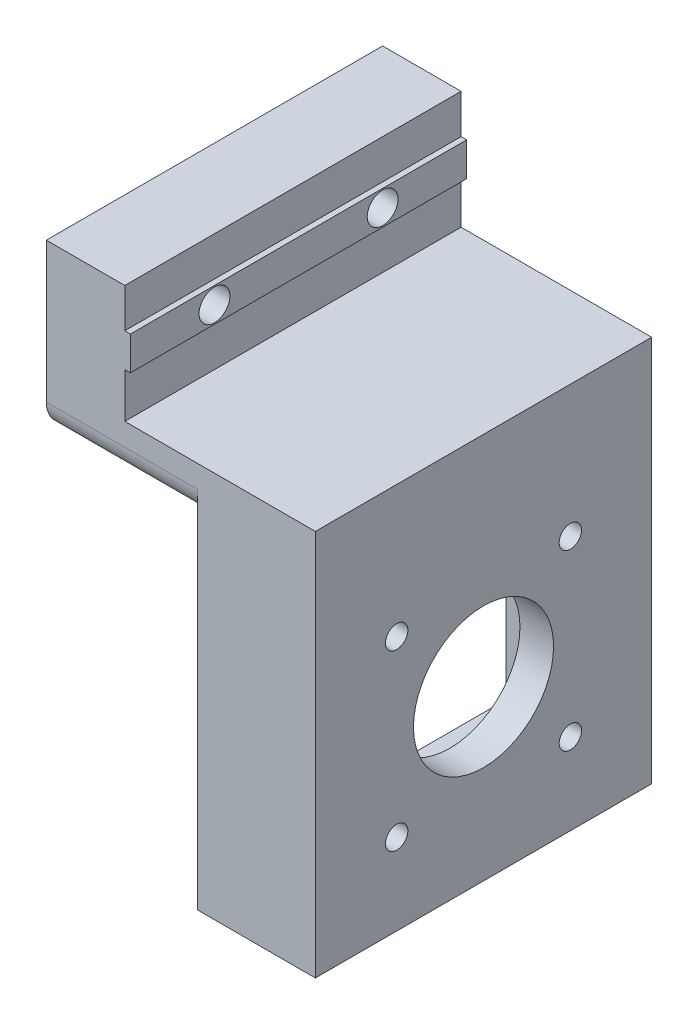
ISO-10303-21;
HEADER;
FILE_DESCRIPTION(('STEP AP214'),'2;1');
FILE_NAME('part.step','',(''),(''),'','','');
FILE_SCHEMA(('AUTOMOTIVE_DESIGN { 1 0 10303 214 1 1 1 1 }'));
ENDSEC;
DATA;
#1=APPLICATION_CONTEXT('core data for automotive mechanical design processes');
#2=APPLICATION_PROTOCOL_DEFINITION('international standard','automotive_design',2000,#1);
#3=PRODUCT_CONTEXT('',#1,'mechanical');
#4=PRODUCT('Part','Part','',(#3));
#5=PRODUCT_RELATED_PRODUCT_CATEGORY('part','',(#4));
#6=PRODUCT_DEFINITION_FORMATION('','',#4);
#7=PRODUCT_DEFINITION_CONTEXT('part definition',#1,'design');
#8=PRODUCT_DEFINITION('design','',#6,#7);
#9=PRODUCT_DEFINITION_SHAPE('','',#8);
#10=(LENGTH_UNIT() NAMED_UNIT(*) SI_UNIT(.MILLI.,.METRE.));
#11=(NAMED_UNIT(*) PLANE_ANGLE_UNIT() SI_UNIT($,.RADIAN.));
#12=(NAMED_UNIT(*) SI_UNIT($,.STERADIAN.) SOLID_ANGLE_UNIT());
#13=UNCERTAINTY_MEASURE_WITH_UNIT(LENGTH_MEASURE(1.E-05),#10,'distance_accuracy_value','');
#14=(GEOMETRIC_REPRESENTATION_CONTEXT(3) GLOBAL_UNCERTAINTY_ASSIGNED_CONTEXT((#13)) GLOBAL_UNIT_ASSIGNED_CONTEXT((#10,
#11,#12)) REPRESENTATION_CONTEXT('',''));
#15=CARTESIAN_POINT('',(0.,0.,0.));
#16=DIRECTION('',(0.,0.,1.));
#17=DIRECTION('',(1.,0.,0.));
#18=AXIS2_PLACEMENT_3D('',#15,#16,#17);
#19=CARTESIAN_POINT('',(48.001,-9.99999999999999,45.));
#20=DIRECTION('',(-1.,0.,0.));
#21=DIRECTION('',(0.,-1.,0.));
#22=AXIS2_PLACEMENT_3D('',#19,#20,#21);
#23=CYLINDRICAL_SURFACE('',#22,2.75);
#24=CARTESIAN_POINT('',(15.,-10.,45.));
#25=DIRECTION('',(1.,0.,0.));
#26=DIRECTION('',(0.,0.,-1.));
#27=AXIS2_PLACEMENT_3D('',#24,#25,#26);
#28=CIRCLE('',#27,2.75);
#29=CARTESIAN_POINT('',(15.,-10.,42.25));
#30=VERTEX_POINT('',#29);
#31=EDGE_CURVE('E307',#30,#30,#28,.F.);
#32=ORIENTED_EDGE('',*,*,#31,.F.);
#33=EDGE_LOOP('',(#32));
#34=FACE_BOUND('',#33,.T.);
#35=CARTESIAN_POINT('',(8.,-10.,45.));
#36=DIRECTION('',(-1.,0.,0.));
#37=DIRECTION('',(0.,-1.,0.));
#38=AXIS2_PLACEMENT_3D('',#35,#36,#37);
#39=CIRCLE('',#38,2.75);
#40=CARTESIAN_POINT('',(8.,-12.75,45.));
#41=VERTEX_POINT('',#40);
#42=EDGE_CURVE('E303',#41,#41,#39,.F.);
#43=ORIENTED_EDGE('',*,*,#42,.F.);
#44=EDGE_LOOP('',(#43));
#45=FACE_BOUND('',#44,.T.);
#46=ADVANCED_FACE('F39',(#34,#45),#23,.F.);
#47=CARTESIAN_POINT('',(48.001,-9.99999999999999,15.));
#48=DIRECTION('',(-1.,0.,0.));
#49=DIRECTION('',(0.,-1.,0.));
#50=AXIS2_PLACEMENT_3D('',#47,#48,#49);
#51=CYLINDRICAL_SURFACE('',#50,2.75);
#52=CARTESIAN_POINT('',(15.,-10.,15.));
#53=DIRECTION('',(1.,0.,0.));
#54=DIRECTION('',(0.,0.,-1.));
#55=AXIS2_PLACEMENT_3D('',#52,#53,#54);
#56=CIRCLE('',#55,2.75);
#57=CARTESIAN_POINT('',(15.,-10.,12.25));
#58=VERTEX_POINT('',#57);
#59=EDGE_CURVE('E669',#58,#58,#56,.F.);
#60=ORIENTED_EDGE('',*,*,#59,.F.);
#61=EDGE_LOOP('',(#60));
#62=FACE_BOUND('',#61,.T.);
#63=CARTESIAN_POINT('',(8.,-10.,15.));
#64=DIRECTION('',(-1.,0.,0.));
#65=DIRECTION('',(0.,-1.,0.));
#66=AXIS2_PLACEMENT_3D('',#63,#64,#65);
#67=CIRCLE('',#66,2.75);
#68=CARTESIAN_POINT('',(8.,-12.75,15.));
#69=VERTEX_POINT('',#68);
#70=EDGE_CURVE('E300',#69,#69,#67,.F.);
#71=ORIENTED_EDGE('',*,*,#70,.F.);
#72=EDGE_LOOP('',(#71));
#73=FACE_BOUND('',#72,.T.);
#74=ADVANCED_FACE('F370',(#62,#73),#51,.F.);
#75=CARTESIAN_POINT('',(14.,-21.,60.));
#76=DIRECTION('',(-1.,0.,0.));
#77=DIRECTION('',(0.,0.,1.));
#78=AXIS2_PLACEMENT_3D('',#75,#76,#77);
#79=PLANE('',#78);
#80=DIRECTION('',(0.,0.,-1.));
#81=VECTOR('',#80,1.);
#82=CARTESIAN_POINT('',(14.,-13.,60.));
#83=LINE('',#82,#81);
#84=CARTESIAN_POINT('',(14.,-13.,60.));
#85=VERTEX_POINT('',#84);
#86=CARTESIAN_POINT('',(14.,-13.,0.));
#87=VERTEX_POINT('',#86);
#88=EDGE_CURVE('E672',#85,#87,#83,.T.);
#89=ORIENTED_EDGE('',*,*,#88,.F.);
#90=DIRECTION('',(0.,1.,0.));
#91=VECTOR('',#90,1.);
#92=CARTESIAN_POINT('',(14.,-21.,60.));
#93=LINE('',#92,#91);
#94=CARTESIAN_POINT('',(14.,-21.,60.));
#95=VERTEX_POINT('',#94);
#96=EDGE_CURVE('E182',#95,#85,#93,.T.);
#97=ORIENTED_EDGE('',*,*,#96,.F.);
#98=DIRECTION('',(0.,0.,-1.));
#99=VECTOR('',#98,1.);
#100=CARTESIAN_POINT('',(14.,-21.,60.));
#101=LINE('',#100,#99);
#102=CARTESIAN_POINT('',(14.,-21.,0.));
#103=VERTEX_POINT('',#102);
#104=EDGE_CURVE('E281',#95,#103,#101,.T.);
#105=ORIENTED_EDGE('',*,*,#104,.T.);
#106=DIRECTION('',(0.,1.,0.));
#107=VECTOR('',#106,1.);
#108=CARTESIAN_POINT('',(14.,-21.,0.));
#109=LINE('',#108,#107);
#110=EDGE_CURVE('E256',#103,#87,#109,.T.);
#111=ORIENTED_EDGE('',*,*,#110,.T.);
#112=EDGE_LOOP('',(#89,#97,#105,#111));
#113=FACE_BOUND('',#112,.T.);
#114=ADVANCED_FACE('F377',(#113),#79,.F.);
#115=DIRECTION('',(0.,0.,1.));
#116=VECTOR('',#115,1.);
#117=CARTESIAN_POINT('',(14.,-7.,60.));
#118=LINE('',#117,#116);
#119=CARTESIAN_POINT('',(14.,-6.99999999999999,0.));
#120=VERTEX_POINT('',#119);
#121=CARTESIAN_POINT('',(14.,-7.,60.));
#122=VERTEX_POINT('',#121);
#123=EDGE_CURVE('E176',#120,#122,#118,.T.);
#124=ORIENTED_EDGE('',*,*,#123,.F.);
#125=CARTESIAN_POINT('',(14.,0.,0.));
#126=VERTEX_POINT('',#125);
#127=EDGE_CURVE('E277',#120,#126,#109,.T.);
#128=ORIENTED_EDGE('',*,*,#127,.T.);
#129=DIRECTION('',(0.,0.,-1.));
#130=VECTOR('',#129,1.);
#131=CARTESIAN_POINT('',(14.,0.,60.));
#132=LINE('',#131,#130);
#133=CARTESIAN_POINT('',(14.,0.,60.));
#134=VERTEX_POINT('',#133);
#135=EDGE_CURVE('E266',#134,#126,#132,.T.);
#136=ORIENTED_EDGE('',*,*,#135,.F.);
#137=EDGE_CURVE('E264',#122,#134,#93,.T.);
#138=ORIENTED_EDGE('',*,*,#137,.F.);
#139=EDGE_LOOP('',(#124,#128,#136,#138));
#140=FACE_BOUND('',#139,.T.);
#141=ADVANCED_FACE('F480',(#140),#79,.F.);
#142=CARTESIAN_POINT('',(0.,-30.,60.));
#143=DIRECTION('',(0.,1.,0.));
#144=DIRECTION('',(0.,0.,1.));
#145=AXIS2_PLACEMENT_3D('',#142,#143,#144);
#146=PLANE('',#145);
#147=DIRECTION('',(1.,0.,0.));
#148=VECTOR('',#147,1.);
#149=CARTESIAN_POINT('',(27.,-30.,55.));
#150=LINE('',#149,#148);
#151=CARTESIAN_POINT('',(27.,-30.,55.));
#152=VERTEX_POINT('',#151);
#153=CARTESIAN_POINT('',(42.,-30.,55.));
#154=VERTEX_POINT('',#153);
#155=EDGE_CURVE('E218',#152,#154,#150,.T.);
#156=ORIENTED_EDGE('',*,*,#155,.F.);
#157=DIRECTION('',(1.,0.,0.));
#158=VECTOR('',#157,1.);
#159=CARTESIAN_POINT('',(0.,-30.,55.));
#160=LINE('',#159,#158);
#161=CARTESIAN_POINT('',(0.,-30.,55.));
#162=VERTEX_POINT('',#161);
#163=EDGE_CURVE('E313',#152,#162,#160,.F.);
#164=ORIENTED_EDGE('',*,*,#163,.T.);
#165=DIRECTION('',(0.,0.,-1.));
#166=VECTOR('',#165,1.);
#167=CARTESIAN_POINT('',(0.,-30.,60.));
#168=LINE('',#167,#166);
#169=CARTESIAN_POINT('',(0.,-30.,5.));
#170=VERTEX_POINT('',#169);
#171=EDGE_CURVE('E293',#162,#170,#168,.T.);
#172=ORIENTED_EDGE('',*,*,#171,.T.);
#173=DIRECTION('',(1.,0.,0.));
#174=VECTOR('',#173,1.);
#175=CARTESIAN_POINT('',(0.,-30.,5.));
#176=LINE('',#175,#174);
#177=CARTESIAN_POINT('',(27.,-30.,5.));
#178=VERTEX_POINT('',#177);
#179=EDGE_CURVE('E310',#170,#178,#176,.T.);
#180=ORIENTED_EDGE('',*,*,#179,.T.);
#181=DIRECTION('',(1.,0.,0.));
#182=VECTOR('',#181,1.);
#183=CARTESIAN_POINT('',(27.,-30.,5.));
#184=LINE('',#183,#182);
#185=CARTESIAN_POINT('',(42.,-30.,5.));
#186=VERTEX_POINT('',#185);
#187=EDGE_CURVE('E205',#178,#186,#184,.T.);
#188=ORIENTED_EDGE('',*,*,#187,.T.);
#189=DIRECTION('',(0.,0.,-1.));
#190=VECTOR('',#189,1.);
#191=CARTESIAN_POINT('',(42.,-30.,60.));
#192=LINE('',#191,#190);
#193=EDGE_CURVE('E290',#154,#186,#192,.T.);
#194=ORIENTED_EDGE('',*,*,#193,.F.);
#195=EDGE_LOOP('',(#156,#164,#172,#180,#188,#194));
#196=FACE_BOUND('',#195,.T.);
#197=ADVANCED_FACE('F331',(#196),#146,.F.);
#198=CARTESIAN_POINT('',(42.,-30.,60.));
#199=DIRECTION('',(1.,0.,0.));
#200=DIRECTION('',(0.,0.,-1.));
#201=AXIS2_PLACEMENT_3D('',#198,#199,#200);
#202=PLANE('',#201);
#203=CARTESIAN_POINT('',(42.,-44.5,45.5));
#204=DIRECTION('',(1.,0.,0.));
#205=DIRECTION('',(0.,0.,-1.));
#206=AXIS2_PLACEMENT_3D('',#203,#204,#205);
#207=CIRCLE('',#206,2.);
#208=CARTESIAN_POINT('',(42.,-44.5,43.5));
#209=VERTEX_POINT('',#208);
#210=EDGE_CURVE('E248',#209,#209,#207,.F.);
#211=ORIENTED_EDGE('',*,*,#210,.F.);
#212=EDGE_LOOP('',(#211));
#213=FACE_BOUND('',#212,.T.);
#214=CARTESIAN_POINT('',(42.,-60.,30.));
#215=DIRECTION('',(1.,0.,0.));
#216=DIRECTION('',(0.,0.,-1.));
#217=AXIS2_PLACEMENT_3D('',#214,#215,#216);
#218=CIRCLE('',#217,12.5);
#219=CARTESIAN_POINT('',(42.,-60.,17.5));
#220=VERTEX_POINT('',#219);
#221=EDGE_CURVE('E221',#220,#220,#218,.F.);
#222=ORIENTED_EDGE('',*,*,#221,.F.);
#223=EDGE_LOOP('',(#222));
#224=FACE_BOUND('',#223,.T.);
#225=CARTESIAN_POINT('',(42.,-75.5,14.5));
#226=DIRECTION('',(1.,0.,0.));
#227=DIRECTION('',(0.,0.,-1.));
#228=AXIS2_PLACEMENT_3D('',#225,#226,#227);
#229=CIRCLE('',#228,2.);
#230=CARTESIAN_POINT('',(42.,-75.5,12.5));
#231=VERTEX_POINT('',#230);
#232=EDGE_CURVE('E222',#231,#231,#229,.F.);
#233=ORIENTED_EDGE('',*,*,#232,.F.);
#234=EDGE_LOOP('',(#233));
#235=FACE_BOUND('',#234,.T.);
#236=CARTESIAN_POINT('',(42.,-75.5,45.5));
#237=DIRECTION('',(1.,0.,0.));
#238=DIRECTION('',(0.,0.,-1.));
#239=AXIS2_PLACEMENT_3D('',#236,#237,#238);
#240=CIRCLE('',#239,2.);
#241=CARTESIAN_POINT('',(42.,-75.5,43.5));
#242=VERTEX_POINT('',#241);
#243=EDGE_CURVE('E229',#242,#242,#240,.F.);
#244=ORIENTED_EDGE('',*,*,#243,.F.);
#245=EDGE_LOOP('',(#244));
#246=FACE_BOUND('',#245,.T.);
#247=CARTESIAN_POINT('',(42.,-44.5,14.5));
#248=DIRECTION('',(1.,0.,0.));
#249=DIRECTION('',(0.,0.,-1.));
#250=AXIS2_PLACEMENT_3D('',#247,#248,#249);
#251=CIRCLE('',#250,2.);
#252=CARTESIAN_POINT('',(42.,-44.5,12.5));
#253=VERTEX_POINT('',#252);
#254=EDGE_CURVE('E234',#253,#253,#251,.F.);
#255=ORIENTED_EDGE('',*,*,#254,.F.);
#256=EDGE_LOOP('',(#255));
#257=FACE_BOUND('',#256,.T.);
#258=DIRECTION('',(0.,-1.,0.));
#259=VECTOR('',#258,1.);
#260=CARTESIAN_POINT('',(42.,-30.,55.));
#261=LINE('',#260,#259);
#262=CARTESIAN_POINT('',(42.,-85.,55.));
#263=VERTEX_POINT('',#262);
#264=EDGE_CURVE('E183',#154,#263,#261,.T.);
#265=ORIENTED_EDGE('',*,*,#264,.F.);
#266=ORIENTED_EDGE('',*,*,#193,.T.);
#267=DIRECTION('',(0.,1.,0.));
#268=VECTOR('',#267,1.);
#269=CARTESIAN_POINT('',(42.,-85.,5.));
#270=LINE('',#269,#268);
#271=CARTESIAN_POINT('',(42.,-85.,5.));
#272=VERTEX_POINT('',#271);
#273=EDGE_CURVE('E194',#272,#186,#270,.T.);
#274=ORIENTED_EDGE('',*,*,#273,.F.);
#275=DIRECTION('',(0.,0.,-1.));
#276=VECTOR('',#275,1.);
#277=CARTESIAN_POINT('',(42.,-85.,55.));
#278=LINE('',#277,#276);
#279=EDGE_CURVE('E186',#263,#272,#278,.T.);
#280=ORIENTED_EDGE('',*,*,#279,.F.);
#281=EDGE_LOOP('',(#265,#266,#274,#280));
#282=FACE_BOUND('',#281,.T.);
#283=ADVANCED_FACE('F355',(#213,#224,#235,#246,#257,#282),#202,.F.);
#284=CARTESIAN_POINT('',(14.,0.,60.));
#285=DIRECTION('',(0.,-1.,0.));
#286=DIRECTION('',(0.,0.,-1.));
#287=AXIS2_PLACEMENT_3D('',#284,#285,#286);
#288=PLANE('',#287);
#289=DIRECTION('',(-1.,0.,0.));
#290=VECTOR('',#289,1.);
#291=CARTESIAN_POINT('',(14.,0.,0.));
#292=LINE('',#291,#290);
#293=CARTESIAN_POINT('',(0.,0.,0.));
#294=VERTEX_POINT('',#293);
#295=EDGE_CURVE('E251',#126,#294,#292,.T.);
#296=ORIENTED_EDGE('',*,*,#295,.T.);
#297=DIRECTION('',(0.,0.,-1.));
#298=VECTOR('',#297,1.);
#299=CARTESIAN_POINT('',(0.,0.,60.));
#300=LINE('',#299,#298);
#301=CARTESIAN_POINT('',(0.,0.,60.));
#302=VERTEX_POINT('',#301);
#303=EDGE_CURVE('E296',#302,#294,#300,.T.);
#304=ORIENTED_EDGE('',*,*,#303,.F.);
#305=DIRECTION('',(-1.,0.,0.));
#306=VECTOR('',#305,1.);
#307=CARTESIAN_POINT('',(14.,0.,60.));
#308=LINE('',#307,#306);
#309=EDGE_CURVE('E252',#134,#302,#308,.T.);
#310=ORIENTED_EDGE('',*,*,#309,.F.);
#311=ORIENTED_EDGE('',*,*,#135,.T.);
#312=EDGE_LOOP('',(#296,#304,#310,#311));
#313=FACE_BOUND('',#312,.T.);
#314=ADVANCED_FACE('F344',(#313),#288,.F.);
#315=CARTESIAN_POINT('',(0.,0.,60.));
#316=DIRECTION('',(1.,0.,0.));
#317=DIRECTION('',(0.,1.,0.));
#318=AXIS2_PLACEMENT_3D('',#315,#316,#317);
#319=PLANE('',#318);
#320=CARTESIAN_POINT('',(0.,-10.,15.));
#321=DIRECTION('',(-1.,0.,0.));
#322=DIRECTION('',(0.,-1.,0.));
#323=AXIS2_PLACEMENT_3D('',#320,#321,#322);
#324=CIRCLE('',#323,6.);
#325=CARTESIAN_POINT('',(0.,-16.,15.));
#326=VERTEX_POINT('',#325);
#327=EDGE_CURVE('E657',#326,#326,#324,.T.);
#328=ORIENTED_EDGE('',*,*,#327,.F.);
#329=EDGE_LOOP('',(#328));
#330=FACE_BOUND('',#329,.T.);
#331=CARTESIAN_POINT('',(0.,-10.,45.));
#332=DIRECTION('',(-1.,0.,0.));
#333=DIRECTION('',(0.,-1.,0.));
#334=AXIS2_PLACEMENT_3D('',#331,#332,#333);
#335=CIRCLE('',#334,6.);
#336=CARTESIAN_POINT('',(0.,-16.,45.));
#337=VERTEX_POINT('',#336);
#338=EDGE_CURVE('E660',#337,#337,#335,.T.);
#339=ORIENTED_EDGE('',*,*,#338,.F.);
#340=EDGE_LOOP('',(#339));
#341=FACE_BOUND('',#340,.T.);
#342=ORIENTED_EDGE('',*,*,#171,.F.);
#343=CARTESIAN_POINT('',(0.,-25.,55.));
#344=DIRECTION('',(1.,0.,0.));
#345=DIRECTION('',(0.,1.,0.));
#346=AXIS2_PLACEMENT_3D('',#343,#344,#345);
#347=CIRCLE('',#346,5.);
#348=CARTESIAN_POINT('',(0.,-25.,60.));
#349=VERTEX_POINT('',#348);
#350=EDGE_CURVE('E317',#162,#349,#347,.F.);
#351=ORIENTED_EDGE('',*,*,#350,.T.);
#352=DIRECTION('',(0.,-1.,0.));
#353=VECTOR('',#352,1.);
#354=CARTESIAN_POINT('',(0.,0.,60.));
#355=LINE('',#354,#353);
#356=EDGE_CURVE('E255',#302,#349,#355,.T.);
#357=ORIENTED_EDGE('',*,*,#356,.F.);
#358=ORIENTED_EDGE('',*,*,#303,.T.);
#359=DIRECTION('',(0.,-1.,0.));
#360=VECTOR('',#359,1.);
#361=CARTESIAN_POINT('',(0.,0.,0.));
#362=LINE('',#361,#360);
#363=CARTESIAN_POINT('',(0.,-25.,0.));
#364=VERTEX_POINT('',#363);
#365=EDGE_CURVE('E269',#294,#364,#362,.T.);
#366=ORIENTED_EDGE('',*,*,#365,.T.);
#367=CARTESIAN_POINT('',(0.,-25.,5.));
#368=DIRECTION('',(1.,0.,0.));
#369=DIRECTION('',(0.,1.,0.));
#370=AXIS2_PLACEMENT_3D('',#367,#368,#369);
#371=CIRCLE('',#370,5.);
#372=EDGE_CURVE('E315',#364,#170,#371,.F.);
#373=ORIENTED_EDGE('',*,*,#372,.T.);
#374=EDGE_LOOP('',(#342,#351,#357,#358,#366,#373));
#375=FACE_BOUND('',#374,.T.);
#376=ADVANCED_FACE('F339',(#330,#341,#375),#319,.F.);
#377=CARTESIAN_POINT('',(42.,-90.,60.));
#378=DIRECTION('',(0.,1.,0.));
#379=DIRECTION('',(0.,0.,1.));
#380=AXIS2_PLACEMENT_3D('',#377,#378,#379);
#381=PLANE('',#380);
#382=DIRECTION('',(1.,0.,0.));
#383=VECTOR('',#382,1.);
#384=CARTESIAN_POINT('',(42.,-90.,0.));
#385=LINE('',#384,#383);
#386=CARTESIAN_POINT('',(27.,-90.,0.));
#387=VERTEX_POINT('',#386);
#388=CARTESIAN_POINT('',(48.,-90.,0.));
#389=VERTEX_POINT('',#388);
#390=EDGE_CURVE('E271',#387,#389,#385,.T.);
#391=ORIENTED_EDGE('',*,*,#390,.T.);
#392=DIRECTION('',(0.,0.,-1.));
#393=VECTOR('',#392,1.);
#394=CARTESIAN_POINT('',(48.,-90.,60.));
#395=LINE('',#394,#393);
#396=CARTESIAN_POINT('',(48.,-90.,60.));
#397=VERTEX_POINT('',#396);
#398=EDGE_CURVE('E287',#397,#389,#395,.T.);
#399=ORIENTED_EDGE('',*,*,#398,.F.);
#400=DIRECTION('',(1.,0.,0.));
#401=VECTOR('',#400,1.);
#402=CARTESIAN_POINT('',(42.,-90.,60.));
#403=LINE('',#402,#401);
#404=CARTESIAN_POINT('',(27.,-90.,60.));
#405=VERTEX_POINT('',#404);
#406=EDGE_CURVE('E258',#405,#397,#403,.T.);
#407=ORIENTED_EDGE('',*,*,#406,.F.);
#408=DIRECTION('',(0.,0.,1.));
#409=VECTOR('',#408,1.);
#410=CARTESIAN_POINT('',(27.,-90.,0.));
#411=LINE('',#410,#409);
#412=EDGE_CURVE('E193',#387,#405,#411,.T.);
#413=ORIENTED_EDGE('',*,*,#412,.F.);
#414=EDGE_LOOP('',(#391,#399,#407,#413));
#415=FACE_BOUND('',#414,.T.);
#416=ADVANCED_FACE('F600',(#415),#381,.F.);
#417=CARTESIAN_POINT('',(48.,-90.,60.));
#418=DIRECTION('',(-1.,0.,0.));
#419=DIRECTION('',(0.,0.,1.));
#420=AXIS2_PLACEMENT_3D('',#417,#418,#419);
#421=PLANE('',#420);
#422=CARTESIAN_POINT('',(48.,-44.5,14.5));
#423=DIRECTION('',(1.,0.,0.));
#424=DIRECTION('',(0.,0.,-1.));
#425=AXIS2_PLACEMENT_3D('',#422,#423,#424);
#426=CIRCLE('',#425,2.);
#427=CARTESIAN_POINT('',(48.,-44.5,12.5));
#428=VERTEX_POINT('',#427);
#429=EDGE_CURVE('E237',#428,#428,#426,.T.);
#430=ORIENTED_EDGE('',*,*,#429,.F.);
#431=EDGE_LOOP('',(#430));
#432=FACE_BOUND('',#431,.T.);
#433=CARTESIAN_POINT('',(48.,-75.5,45.5));
#434=DIRECTION('',(1.,0.,0.));
#435=DIRECTION('',(0.,0.,-1.));
#436=AXIS2_PLACEMENT_3D('',#433,#434,#435);
#437=CIRCLE('',#436,2.);
#438=CARTESIAN_POINT('',(48.,-75.5,43.5));
#439=VERTEX_POINT('',#438);
#440=EDGE_CURVE('E238',#439,#439,#437,.T.);
#441=ORIENTED_EDGE('',*,*,#440,.F.);
#442=EDGE_LOOP('',(#441));
#443=FACE_BOUND('',#442,.T.);
#444=CARTESIAN_POINT('',(48.,-75.5,14.5));
#445=DIRECTION('',(1.,0.,0.));
#446=DIRECTION('',(0.,0.,-1.));
#447=AXIS2_PLACEMENT_3D('',#444,#445,#446);
#448=CIRCLE('',#447,2.);
#449=CARTESIAN_POINT('',(48.,-75.5,12.5));
#450=VERTEX_POINT('',#449);
#451=EDGE_CURVE('E225',#450,#450,#448,.T.);
#452=ORIENTED_EDGE('',*,*,#451,.F.);
#453=EDGE_LOOP('',(#452));
#454=FACE_BOUND('',#453,.T.);
#455=CARTESIAN_POINT('',(48.,-60.,30.));
#456=DIRECTION('',(1.,0.,0.));
#457=DIRECTION('',(0.,0.,-1.));
#458=AXIS2_PLACEMENT_3D('',#455,#456,#457);
#459=CIRCLE('',#458,12.5);
#460=CARTESIAN_POINT('',(48.,-60.,17.5));
#461=VERTEX_POINT('',#460);
#462=EDGE_CURVE('E226',#461,#461,#459,.T.);
#463=ORIENTED_EDGE('',*,*,#462,.F.);
#464=EDGE_LOOP('',(#463));
#465=FACE_BOUND('',#464,.T.);
#466=CARTESIAN_POINT('',(48.,-44.5,45.5));
#467=DIRECTION('',(1.,0.,0.));
#468=DIRECTION('',(0.,0.,-1.));
#469=AXIS2_PLACEMENT_3D('',#466,#467,#468);
#470=CIRCLE('',#469,2.);
#471=CARTESIAN_POINT('',(48.,-44.5,43.5));
#472=VERTEX_POINT('',#471);
#473=EDGE_CURVE('E241',#472,#472,#470,.T.);
#474=ORIENTED_EDGE('',*,*,#473,.F.);
#475=EDGE_LOOP('',(#474));
#476=FACE_BOUND('',#475,.T.);
#477=DIRECTION('',(0.,1.,0.));
#478=VECTOR('',#477,1.);
#479=CARTESIAN_POINT('',(48.,-90.,0.));
#480=LINE('',#479,#478);
#481=CARTESIAN_POINT('',(48.,-21.,0.));
#482=VERTEX_POINT('',#481);
#483=EDGE_CURVE('E273',#389,#482,#480,.T.);
#484=ORIENTED_EDGE('',*,*,#483,.T.);
#485=DIRECTION('',(0.,0.,-1.));
#486=VECTOR('',#485,1.);
#487=CARTESIAN_POINT('',(48.,-21.,60.));
#488=LINE('',#487,#486);
#489=CARTESIAN_POINT('',(48.,-21.,60.));
#490=VERTEX_POINT('',#489);
#491=EDGE_CURVE('E284',#490,#482,#488,.T.);
#492=ORIENTED_EDGE('',*,*,#491,.F.);
#493=DIRECTION('',(0.,1.,0.));
#494=VECTOR('',#493,1.);
#495=CARTESIAN_POINT('',(48.,-90.,60.));
#496=LINE('',#495,#494);
#497=EDGE_CURVE('E260',#397,#490,#496,.T.);
#498=ORIENTED_EDGE('',*,*,#497,.F.);
#499=ORIENTED_EDGE('',*,*,#398,.T.);
#500=EDGE_LOOP('',(#484,#492,#498,#499));
#501=FACE_BOUND('',#500,.T.);
#502=ADVANCED_FACE('F591',(#432,#443,#454,#465,#476,#501),#421,.F.);
#503=CARTESIAN_POINT('',(48.,-21.,60.));
#504=DIRECTION('',(0.,-1.,0.));
#505=DIRECTION('',(1.,0.,0.));
#506=AXIS2_PLACEMENT_3D('',#503,#504,#505);
#507=PLANE('',#506);
#508=DIRECTION('',(-1.,0.,0.));
#509=VECTOR('',#508,1.);
#510=CARTESIAN_POINT('',(48.,-21.,0.));
#511=LINE('',#510,#509);
#512=EDGE_CURVE('E275',#482,#103,#511,.T.);
#513=ORIENTED_EDGE('',*,*,#512,.T.);
#514=ORIENTED_EDGE('',*,*,#104,.F.);
#515=DIRECTION('',(-1.,0.,0.));
#516=VECTOR('',#515,1.);
#517=CARTESIAN_POINT('',(48.,-21.,60.));
#518=LINE('',#517,#516);
#519=EDGE_CURVE('E262',#490,#95,#518,.T.);
#520=ORIENTED_EDGE('',*,*,#519,.F.);
#521=ORIENTED_EDGE('',*,*,#491,.T.);
#522=EDGE_LOOP('',(#513,#514,#520,#521));
#523=FACE_BOUND('',#522,.T.);
#524=ADVANCED_FACE('F582',(#523),#507,.F.);
#525=CARTESIAN_POINT('',(0.,0.,60.));
#526=DIRECTION('',(0.,0.,1.));
#527=DIRECTION('',(1.,0.,0.));
#528=AXIS2_PLACEMENT_3D('',#525,#526,#527);
#529=PLANE('',#528);
#530=ORIENTED_EDGE('',*,*,#356,.T.);
#531=DIRECTION('',(1.,0.,0.));
#532=VECTOR('',#531,1.);
#533=CARTESIAN_POINT('',(27.,-25.,60.));
#534=LINE('',#533,#532);
#535=CARTESIAN_POINT('',(27.,-25.,60.));
#536=VERTEX_POINT('',#535);
#537=EDGE_CURVE('E299',#349,#536,#534,.T.);
#538=ORIENTED_EDGE('',*,*,#537,.T.);
#539=DIRECTION('',(0.,1.,0.));
#540=VECTOR('',#539,1.);
#541=CARTESIAN_POINT('',(27.,-90.,60.));
#542=LINE('',#541,#540);
#543=EDGE_CURVE('E197',#405,#536,#542,.T.);
#544=ORIENTED_EDGE('',*,*,#543,.F.);
#545=ORIENTED_EDGE('',*,*,#406,.T.);
#546=ORIENTED_EDGE('',*,*,#497,.T.);
#547=ORIENTED_EDGE('',*,*,#519,.T.);
#548=ORIENTED_EDGE('',*,*,#96,.T.);
#549=DIRECTION('',(-1.,0.,0.));
#550=VECTOR('',#549,1.);
#551=CARTESIAN_POINT('',(15.,-13.,60.));
#552=LINE('',#551,#550);
#553=CARTESIAN_POINT('',(15.,-13.,60.));
#554=VERTEX_POINT('',#553);
#555=EDGE_CURVE('E161',#554,#85,#552,.T.);
#556=ORIENTED_EDGE('',*,*,#555,.F.);
#557=DIRECTION('',(0.,-1.,0.));
#558=VECTOR('',#557,1.);
#559=CARTESIAN_POINT('',(15.,-7.,60.));
#560=LINE('',#559,#558);
#561=CARTESIAN_POINT('',(15.,-7.,60.));
#562=VERTEX_POINT('',#561);
#563=EDGE_CURVE('E167',#562,#554,#560,.T.);
#564=ORIENTED_EDGE('',*,*,#563,.F.);
#565=DIRECTION('',(-1.,0.,0.));
#566=VECTOR('',#565,1.);
#567=CARTESIAN_POINT('',(15.,-7.,60.));
#568=LINE('',#567,#566);
#569=EDGE_CURVE('E677',#562,#122,#568,.T.);
#570=ORIENTED_EDGE('',*,*,#569,.T.);
#571=ORIENTED_EDGE('',*,*,#137,.T.);
#572=ORIENTED_EDGE('',*,*,#309,.T.);
#573=EDGE_LOOP('',(#530,#538,#544,#545,#546,#547,#548,#556,#564,#570,#571,#572));
#574=FACE_BOUND('',#573,.T.);
#575=ADVANCED_FACE('F180',(#574),#529,.T.);
#576=CARTESIAN_POINT('',(0.,0.,0.));
#577=DIRECTION('',(0.,0.,1.));
#578=DIRECTION('',(1.,0.,0.));
#579=AXIS2_PLACEMENT_3D('',#576,#577,#578);
#580=PLANE('',#579);
#581=DIRECTION('',(0.,-1.,0.));
#582=VECTOR('',#581,1.);
#583=CARTESIAN_POINT('',(27.,-30.,0.));
#584=LINE('',#583,#582);
#585=CARTESIAN_POINT('',(27.,-25.,0.));
#586=VERTEX_POINT('',#585);
#587=EDGE_CURVE('E54',#586,#387,#584,.T.);
#588=ORIENTED_EDGE('',*,*,#587,.F.);
#589=DIRECTION('',(1.,0.,0.));
#590=VECTOR('',#589,1.);
#591=CARTESIAN_POINT('',(0.,-25.,0.));
#592=LINE('',#591,#590);
#593=EDGE_CURVE('E58',#586,#364,#592,.F.);
#594=ORIENTED_EDGE('',*,*,#593,.T.);
#595=ORIENTED_EDGE('',*,*,#365,.F.);
#596=ORIENTED_EDGE('',*,*,#295,.F.);
#597=ORIENTED_EDGE('',*,*,#127,.F.);
#598=DIRECTION('',(-1.,0.,0.));
#599=VECTOR('',#598,1.);
#600=CARTESIAN_POINT('',(15.,-6.99999999999999,0.));
#601=LINE('',#600,#599);
#602=CARTESIAN_POINT('',(15.,-6.99999999999999,0.));
#603=VERTEX_POINT('',#602);
#604=EDGE_CURVE('E188',#603,#120,#601,.T.);
#605=ORIENTED_EDGE('',*,*,#604,.F.);
#606=DIRECTION('',(0.,1.,0.));
#607=VECTOR('',#606,1.);
#608=CARTESIAN_POINT('',(15.,-6.99999999999999,0.));
#609=LINE('',#608,#607);
#610=CARTESIAN_POINT('',(15.,-13.,0.));
#611=VERTEX_POINT('',#610);
#612=EDGE_CURVE('E166',#611,#603,#609,.T.);
#613=ORIENTED_EDGE('',*,*,#612,.F.);
#614=DIRECTION('',(-1.,0.,0.));
#615=VECTOR('',#614,1.);
#616=CARTESIAN_POINT('',(15.,-13.,0.));
#617=LINE('',#616,#615);
#618=EDGE_CURVE('E163',#611,#87,#617,.T.);
#619=ORIENTED_EDGE('',*,*,#618,.T.);
#620=ORIENTED_EDGE('',*,*,#110,.F.);
#621=ORIENTED_EDGE('',*,*,#512,.F.);
#622=ORIENTED_EDGE('',*,*,#483,.F.);
#623=ORIENTED_EDGE('',*,*,#390,.F.);
#624=EDGE_LOOP('',(#588,#594,#595,#596,#597,#605,#613,#619,#620,#621,#622,#623));
#625=FACE_BOUND('',#624,.T.);
#626=ADVANCED_FACE('F566',(#625),#580,.F.);
#627=CARTESIAN_POINT('',(-0.001000000000001,-44.5,45.5));
#628=DIRECTION('',(1.,0.,0.));
#629=DIRECTION('',(0.,0.,-1.));
#630=AXIS2_PLACEMENT_3D('',#627,#628,#629);
#631=CYLINDRICAL_SURFACE('',#630,2.);
#632=ORIENTED_EDGE('',*,*,#473,.T.);
#633=EDGE_LOOP('',(#632));
#634=FACE_BOUND('',#633,.T.);
#635=ORIENTED_EDGE('',*,*,#210,.T.);
#636=EDGE_LOOP('',(#635));
#637=FACE_BOUND('',#636,.T.);
#638=ADVANCED_FACE('F557',(#634,#637),#631,.F.);
#639=CARTESIAN_POINT('',(-0.001000000000001,-60.,30.));
#640=DIRECTION('',(1.,0.,0.));
#641=DIRECTION('',(0.,0.,-1.));
#642=AXIS2_PLACEMENT_3D('',#639,#640,#641);
#643=CYLINDRICAL_SURFACE('',#642,12.5);
#644=ORIENTED_EDGE('',*,*,#462,.T.);
#645=EDGE_LOOP('',(#644));
#646=FACE_BOUND('',#645,.T.);
#647=ORIENTED_EDGE('',*,*,#221,.T.);
#648=EDGE_LOOP('',(#647));
#649=FACE_BOUND('',#648,.T.);
#650=ADVANCED_FACE('F548',(#646,#649),#643,.F.);
#651=CARTESIAN_POINT('',(-0.001000000000001,-75.5,14.5));
#652=DIRECTION('',(1.,0.,0.));
#653=DIRECTION('',(0.,0.,-1.));
#654=AXIS2_PLACEMENT_3D('',#651,#652,#653);
#655=CYLINDRICAL_SURFACE('',#654,2.);
#656=ORIENTED_EDGE('',*,*,#451,.T.);
#657=EDGE_LOOP('',(#656));
#658=FACE_BOUND('',#657,.T.);
#659=ORIENTED_EDGE('',*,*,#232,.T.);
#660=EDGE_LOOP('',(#659));
#661=FACE_BOUND('',#660,.T.);
#662=ADVANCED_FACE('F539',(#658,#661),#655,.F.);
#663=CARTESIAN_POINT('',(-0.001000000000001,-75.5,45.5));
#664=DIRECTION('',(1.,0.,0.));
#665=DIRECTION('',(0.,0.,-1.));
#666=AXIS2_PLACEMENT_3D('',#663,#664,#665);
#667=CYLINDRICAL_SURFACE('',#666,2.);
#668=ORIENTED_EDGE('',*,*,#440,.T.);
#669=EDGE_LOOP('',(#668));
#670=FACE_BOUND('',#669,.T.);
#671=ORIENTED_EDGE('',*,*,#243,.T.);
#672=EDGE_LOOP('',(#671));
#673=FACE_BOUND('',#672,.T.);
#674=ADVANCED_FACE('F530',(#670,#673),#667,.F.);
#675=CARTESIAN_POINT('',(-0.001000000000001,-44.5,14.5));
#676=DIRECTION('',(1.,0.,0.));
#677=DIRECTION('',(0.,0.,-1.));
#678=AXIS2_PLACEMENT_3D('',#675,#676,#677);
#679=CYLINDRICAL_SURFACE('',#678,2.);
#680=ORIENTED_EDGE('',*,*,#429,.T.);
#681=EDGE_LOOP('',(#680));
#682=FACE_BOUND('',#681,.T.);
#683=ORIENTED_EDGE('',*,*,#254,.T.);
#684=EDGE_LOOP('',(#683));
#685=FACE_BOUND('',#684,.T.);
#686=ADVANCED_FACE('F367',(#682,#685),#679,.F.);
#687=CARTESIAN_POINT('',(27.,-30.,55.));
#688=DIRECTION('',(0.,0.,1.));
#689=DIRECTION('',(0.,-1.,0.));
#690=AXIS2_PLACEMENT_3D('',#687,#688,#689);
#691=PLANE('',#690);
#692=ORIENTED_EDGE('',*,*,#264,.T.);
#693=DIRECTION('',(1.,0.,0.));
#694=VECTOR('',#693,1.);
#695=CARTESIAN_POINT('',(27.,-85.,55.));
#696=LINE('',#695,#694);
#697=CARTESIAN_POINT('',(27.,-85.,55.));
#698=VERTEX_POINT('',#697);
#699=EDGE_CURVE('E215',#698,#263,#696,.T.);
#700=ORIENTED_EDGE('',*,*,#699,.F.);
#701=DIRECTION('',(0.,-1.,0.));
#702=VECTOR('',#701,1.);
#703=CARTESIAN_POINT('',(27.,-30.,55.));
#704=LINE('',#703,#702);
#705=EDGE_CURVE('E199',#152,#698,#704,.T.);
#706=ORIENTED_EDGE('',*,*,#705,.F.);
#707=ORIENTED_EDGE('',*,*,#155,.T.);
#708=EDGE_LOOP('',(#692,#700,#706,#707));
#709=FACE_BOUND('',#708,.T.);
#710=ADVANCED_FACE('F334',(#709),#691,.F.);
#711=CARTESIAN_POINT('',(27.,-85.,55.));
#712=DIRECTION('',(0.,-1.,0.));
#713=DIRECTION('',(0.,0.,-1.));
#714=AXIS2_PLACEMENT_3D('',#711,#712,#713);
#715=PLANE('',#714);
#716=ORIENTED_EDGE('',*,*,#279,.T.);
#717=DIRECTION('',(1.,0.,0.));
#718=VECTOR('',#717,1.);
#719=CARTESIAN_POINT('',(27.,-85.,5.));
#720=LINE('',#719,#718);
#721=CARTESIAN_POINT('',(27.,-85.,5.));
#722=VERTEX_POINT('',#721);
#723=EDGE_CURVE('E212',#722,#272,#720,.T.);
#724=ORIENTED_EDGE('',*,*,#723,.F.);
#725=DIRECTION('',(0.,0.,-1.));
#726=VECTOR('',#725,1.);
#727=CARTESIAN_POINT('',(27.,-85.,55.));
#728=LINE('',#727,#726);
#729=EDGE_CURVE('E201',#698,#722,#728,.T.);
#730=ORIENTED_EDGE('',*,*,#729,.F.);
#731=ORIENTED_EDGE('',*,*,#699,.T.);
#732=EDGE_LOOP('',(#716,#724,#730,#731));
#733=FACE_BOUND('',#732,.T.);
#734=ADVANCED_FACE('F357',(#733),#715,.F.);
#735=CARTESIAN_POINT('',(27.,-85.,5.));
#736=DIRECTION('',(0.,0.,-1.));
#737=DIRECTION('',(-1.,0.,0.));
#738=AXIS2_PLACEMENT_3D('',#735,#736,#737);
#739=PLANE('',#738);
#740=ORIENTED_EDGE('',*,*,#273,.T.);
#741=ORIENTED_EDGE('',*,*,#187,.F.);
#742=DIRECTION('',(0.,1.,0.));
#743=VECTOR('',#742,1.);
#744=CARTESIAN_POINT('',(27.,-85.,5.));
#745=LINE('',#744,#743);
#746=EDGE_CURVE('E203',#722,#178,#745,.T.);
#747=ORIENTED_EDGE('',*,*,#746,.F.);
#748=ORIENTED_EDGE('',*,*,#723,.T.);
#749=EDGE_LOOP('',(#740,#741,#747,#748));
#750=FACE_BOUND('',#749,.T.);
#751=ADVANCED_FACE('F353',(#750),#739,.F.);
#752=CARTESIAN_POINT('',(27.,0.,0.));
#753=DIRECTION('',(-1.,0.,0.));
#754=DIRECTION('',(0.,0.,1.));
#755=AXIS2_PLACEMENT_3D('',#752,#753,#754);
#756=PLANE('',#755);
#757=ORIENTED_EDGE('',*,*,#746,.T.);
#758=CARTESIAN_POINT('',(27.,-25.,5.));
#759=DIRECTION('',(-1.,0.,0.));
#760=DIRECTION('',(0.,0.,1.));
#761=AXIS2_PLACEMENT_3D('',#758,#759,#760);
#762=CIRCLE('',#761,5.);
#763=EDGE_CURVE('E11',#178,#586,#762,.F.);
#764=ORIENTED_EDGE('',*,*,#763,.T.);
#765=ORIENTED_EDGE('',*,*,#587,.T.);
#766=ORIENTED_EDGE('',*,*,#412,.T.);
#767=ORIENTED_EDGE('',*,*,#543,.T.);
#768=CARTESIAN_POINT('',(27.,-25.,55.));
#769=DIRECTION('',(-1.,0.,0.));
#770=DIRECTION('',(0.,0.,1.));
#771=AXIS2_PLACEMENT_3D('',#768,#769,#770);
#772=CIRCLE('',#771,5.);
#773=EDGE_CURVE('E47',#536,#152,#772,.F.);
#774=ORIENTED_EDGE('',*,*,#773,.T.);
#775=ORIENTED_EDGE('',*,*,#705,.T.);
#776=ORIENTED_EDGE('',*,*,#729,.T.);
#777=EDGE_LOOP('',(#757,#764,#765,#766,#767,#774,#775,#776));
#778=FACE_BOUND('',#777,.T.);
#779=ADVANCED_FACE('F322',(#778),#756,.T.);
#780=CARTESIAN_POINT('',(15.,-13.,60.));
#781=DIRECTION('',(0.,1.,0.));
#782=DIRECTION('',(0.,0.,1.));
#783=AXIS2_PLACEMENT_3D('',#780,#781,#782);
#784=PLANE('',#783);
#785=ORIENTED_EDGE('',*,*,#88,.T.);
#786=ORIENTED_EDGE('',*,*,#618,.F.);
#787=DIRECTION('',(0.,0.,-1.));
#788=VECTOR('',#787,1.);
#789=CARTESIAN_POINT('',(15.,-13.,60.));
#790=LINE('',#789,#788);
#791=EDGE_CURVE('E156',#554,#611,#790,.T.);
#792=ORIENTED_EDGE('',*,*,#791,.F.);
#793=ORIENTED_EDGE('',*,*,#555,.T.);
#794=EDGE_LOOP('',(#785,#786,#792,#793));
#795=FACE_BOUND('',#794,.T.);
#796=ADVANCED_FACE('F159',(#795),#784,.F.);
#797=CARTESIAN_POINT('',(15.,-7.,60.));
#798=DIRECTION('',(0.,-1.,0.));
#799=DIRECTION('',(0.,0.,-1.));
#800=AXIS2_PLACEMENT_3D('',#797,#798,#799);
#801=PLANE('',#800);
#802=ORIENTED_EDGE('',*,*,#123,.T.);
#803=ORIENTED_EDGE('',*,*,#569,.F.);
#804=DIRECTION('',(0.,0.,1.));
#805=VECTOR('',#804,1.);
#806=CARTESIAN_POINT('',(15.,-7.,60.));
#807=LINE('',#806,#805);
#808=EDGE_CURVE('E172',#603,#562,#807,.T.);
#809=ORIENTED_EDGE('',*,*,#808,.F.);
#810=ORIENTED_EDGE('',*,*,#604,.T.);
#811=EDGE_LOOP('',(#802,#803,#809,#810));
#812=FACE_BOUND('',#811,.T.);
#813=ADVANCED_FACE('F386',(#812),#801,.F.);
#814=CARTESIAN_POINT('',(15.,0.,0.));
#815=DIRECTION('',(1.,0.,0.));
#816=DIRECTION('',(0.,0.,-1.));
#817=AXIS2_PLACEMENT_3D('',#814,#815,#816);
#818=PLANE('',#817);
#819=ORIENTED_EDGE('',*,*,#59,.T.);
#820=EDGE_LOOP('',(#819));
#821=FACE_BOUND('',#820,.T.);
#822=ORIENTED_EDGE('',*,*,#31,.T.);
#823=EDGE_LOOP('',(#822));
#824=FACE_BOUND('',#823,.T.);
#825=ORIENTED_EDGE('',*,*,#563,.T.);
#826=ORIENTED_EDGE('',*,*,#791,.T.);
#827=ORIENTED_EDGE('',*,*,#612,.T.);
#828=ORIENTED_EDGE('',*,*,#808,.T.);
#829=EDGE_LOOP('',(#825,#826,#827,#828));
#830=FACE_BOUND('',#829,.T.);
#831=ADVANCED_FACE('F170',(#821,#824,#830),#818,.T.);
#832=CARTESIAN_POINT('',(8.,-10.,15.));
#833=DIRECTION('',(-1.,0.,0.));
#834=DIRECTION('',(0.,-1.,0.));
#835=AXIS2_PLACEMENT_3D('',#832,#833,#834);
#836=PLANE('',#835);
#837=CARTESIAN_POINT('',(8.,-10.,15.));
#838=DIRECTION('',(-1.,0.,0.));
#839=DIRECTION('',(0.,-1.,0.));
#840=AXIS2_PLACEMENT_3D('',#837,#838,#839);
#841=CIRCLE('',#840,6.);
#842=CARTESIAN_POINT('',(8.,-16.,15.));
#843=VERTEX_POINT('',#842);
#844=EDGE_CURVE('E304',#843,#843,#841,.T.);
#845=ORIENTED_EDGE('',*,*,#844,.T.);
#846=EDGE_LOOP('',(#845));
#847=FACE_BOUND('',#846,.T.);
#848=ORIENTED_EDGE('',*,*,#70,.T.);
#849=EDGE_LOOP('',(#848));
#850=FACE_BOUND('',#849,.T.);
#851=ADVANCED_FACE('F385',(#847,#850),#836,.T.);
#852=CARTESIAN_POINT('',(8.,-10.,15.));
#853=DIRECTION('',(-1.,0.,0.));
#854=DIRECTION('',(0.,-1.,0.));
#855=AXIS2_PLACEMENT_3D('',#852,#853,#854);
#856=CYLINDRICAL_SURFACE('',#855,6.);
#857=ORIENTED_EDGE('',*,*,#844,.F.);
#858=EDGE_LOOP('',(#857));
#859=FACE_BOUND('',#858,.T.);
#860=ORIENTED_EDGE('',*,*,#327,.T.);
#861=EDGE_LOOP('',(#860));
#862=FACE_BOUND('',#861,.T.);
#863=ADVANCED_FACE('F431',(#859,#862),#856,.F.);
#864=CARTESIAN_POINT('',(8.,-10.,45.));
#865=DIRECTION('',(-1.,0.,0.));
#866=DIRECTION('',(0.,-1.,0.));
#867=AXIS2_PLACEMENT_3D('',#864,#865,#866);
#868=PLANE('',#867);
#869=CARTESIAN_POINT('',(8.,-10.,45.));
#870=DIRECTION('',(-1.,0.,0.));
#871=DIRECTION('',(0.,-1.,0.));
#872=AXIS2_PLACEMENT_3D('',#869,#870,#871);
#873=CIRCLE('',#872,6.);
#874=CARTESIAN_POINT('',(8.,-16.,45.));
#875=VERTEX_POINT('',#874);
#876=EDGE_CURVE('E662',#875,#875,#873,.T.);
#877=ORIENTED_EDGE('',*,*,#876,.T.);
#878=EDGE_LOOP('',(#877));
#879=FACE_BOUND('',#878,.T.);
#880=ORIENTED_EDGE('',*,*,#42,.T.);
#881=EDGE_LOOP('',(#880));
#882=FACE_BOUND('',#881,.T.);
#883=ADVANCED_FACE('F422',(#879,#882),#868,.T.);
#884=CARTESIAN_POINT('',(8.,-10.,45.));
#885=DIRECTION('',(-1.,0.,0.));
#886=DIRECTION('',(0.,-1.,0.));
#887=AXIS2_PLACEMENT_3D('',#884,#885,#886);
#888=CYLINDRICAL_SURFACE('',#887,6.);
#889=ORIENTED_EDGE('',*,*,#876,.F.);
#890=EDGE_LOOP('',(#889));
#891=FACE_BOUND('',#890,.T.);
#892=ORIENTED_EDGE('',*,*,#338,.T.);
#893=EDGE_LOOP('',(#892));
#894=FACE_BOUND('',#893,.T.);
#895=ADVANCED_FACE('F406',(#891,#894),#888,.F.);
#896=CARTESIAN_POINT('',(0.,-25.,55.));
#897=DIRECTION('',(-1.,0.,0.));
#898=DIRECTION('',(0.,0.,1.));
#899=AXIS2_PLACEMENT_3D('',#896,#897,#898);
#900=CYLINDRICAL_SURFACE('',#899,5.);
#901=ORIENTED_EDGE('',*,*,#350,.F.);
#902=ORIENTED_EDGE('',*,*,#163,.F.);
#903=ORIENTED_EDGE('',*,*,#773,.F.);
#904=ORIENTED_EDGE('',*,*,#537,.F.);
#905=EDGE_LOOP('',(#901,#902,#903,#904));
#906=FACE_BOUND('',#905,.T.);
#907=ADVANCED_FACE('F337',(#906),#900,.T.);
#908=CARTESIAN_POINT('',(0.,-25.,5.));
#909=DIRECTION('',(1.,0.,0.));
#910=DIRECTION('',(0.,0.,-1.));
#911=AXIS2_PLACEMENT_3D('',#908,#909,#910);
#912=CYLINDRICAL_SURFACE('',#911,5.);
#913=ORIENTED_EDGE('',*,*,#372,.F.);
#914=ORIENTED_EDGE('',*,*,#593,.F.);
#915=ORIENTED_EDGE('',*,*,#763,.F.);
#916=ORIENTED_EDGE('',*,*,#179,.F.);
#917=EDGE_LOOP('',(#913,#914,#915,#916));
#918=FACE_BOUND('',#917,.T.);
#919=ADVANCED_FACE('F41',(#918),#912,.T.);
#920=CLOSED_SHELL('',(#46,#74,#114,#141,#197,#283,#314,#376,#416,#502,#524,#575,#626,#638,#650,
#662,#674,#686,#710,#734,#751,#779,#796,#813,#831,#851,#863,#883,#895,#907,#919));
#921=MANIFOLD_SOLID_BREP('B2',#920);
#922=ADVANCED_BREP_SHAPE_REPRESENTATION('',(#18,#921),#14);
#923=SHAPE_DEFINITION_REPRESENTATION(#9,#922);
ENDSEC;
END-ISO-10303-21;
